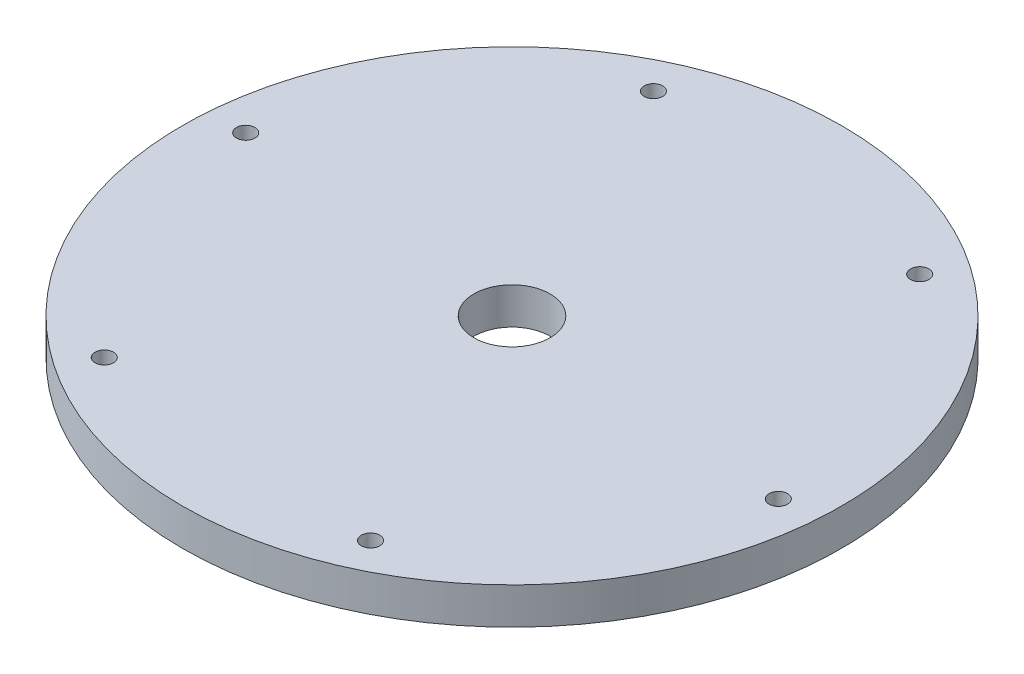
ISO-10303-21;
HEADER;
FILE_DESCRIPTION(('STEP AP214'),'2;1');
FILE_NAME('part.step','',(''),(''),'','','');
FILE_SCHEMA(('AUTOMOTIVE_DESIGN { 1 0 10303 214 1 1 1 1 }'));
ENDSEC;
DATA;
#1=APPLICATION_CONTEXT('core data for automotive mechanical design processes');
#2=APPLICATION_PROTOCOL_DEFINITION('international standard','automotive_design',2000,#1);
#3=PRODUCT_CONTEXT('',#1,'mechanical');
#4=PRODUCT('Part','Part','',(#3));
#5=PRODUCT_RELATED_PRODUCT_CATEGORY('part','',(#4));
#6=PRODUCT_DEFINITION_FORMATION('','',#4);
#7=PRODUCT_DEFINITION_CONTEXT('part definition',#1,'design');
#8=PRODUCT_DEFINITION('design','',#6,#7);
#9=PRODUCT_DEFINITION_SHAPE('','',#8);
#10=(LENGTH_UNIT() NAMED_UNIT(*) SI_UNIT(.MILLI.,.METRE.));
#11=(NAMED_UNIT(*) PLANE_ANGLE_UNIT() SI_UNIT($,.RADIAN.));
#12=(NAMED_UNIT(*) SI_UNIT($,.STERADIAN.) SOLID_ANGLE_UNIT());
#13=UNCERTAINTY_MEASURE_WITH_UNIT(LENGTH_MEASURE(1.E-05),#10,'distance_accuracy_value','');
#14=(GEOMETRIC_REPRESENTATION_CONTEXT(3) GLOBAL_UNCERTAINTY_ASSIGNED_CONTEXT((#13)) GLOBAL_UNIT_ASSIGNED_CONTEXT((#10,
#11,#12)) REPRESENTATION_CONTEXT('',''));
#15=CARTESIAN_POINT('',(0.,0.,0.));
#16=DIRECTION('',(0.,0.,1.));
#17=DIRECTION('',(1.,0.,0.));
#18=AXIS2_PLACEMENT_3D('',#15,#16,#17);
#19=CARTESIAN_POINT('',(0.,5.9563,0.));
#20=DIRECTION('',(0.,1.,0.));
#21=DIRECTION('',(0.,0.,1.));
#22=AXIS2_PLACEMENT_3D('',#19,#20,#21);
#23=PLANE('',#22);
#24=CARTESIAN_POINT('',(-20.122190112367,5.9563,-43.1032939849393));
#25=DIRECTION('',(0.,1.,0.));
#26=DIRECTION('',(0.,0.,1.));
#27=AXIS2_PLACEMENT_3D('',#24,#25,#26);
#28=CIRCLE('',#27,1.4986);
#29=CARTESIAN_POINT('',(-20.122190112367,5.9563,-41.6046939849393));
#30=VERTEX_POINT('',#29);
#31=EDGE_CURVE('E90',#30,#30,#28,.T.);
#32=ORIENTED_EDGE('',*,*,#31,.F.);
#33=EDGE_LOOP('',(#32));
#34=FACE_BOUND('',#33,.T.);
#35=CARTESIAN_POINT('',(-27.2674525215629,5.9563,38.9779748095595));
#36=DIRECTION('',(0.,1.,0.));
#37=DIRECTION('',(0.,0.,1.));
#38=AXIS2_PLACEMENT_3D('',#35,#36,#37);
#39=CIRCLE('',#38,1.4986);
#40=CARTESIAN_POINT('',(-27.2674525215629,5.9563,40.4765748095595));
#41=VERTEX_POINT('',#40);
#42=EDGE_CURVE('E74',#41,#41,#39,.T.);
#43=ORIENTED_EDGE('',*,*,#42,.F.);
#44=EDGE_LOOP('',(#43));
#45=FACE_BOUND('',#44,.T.);
#46=CARTESIAN_POINT('',(47.3896426339299,5.9563,4.12531917537975));
#47=DIRECTION('',(0.,1.,0.));
#48=DIRECTION('',(0.,0.,1.));
#49=AXIS2_PLACEMENT_3D('',#46,#47,#48);
#50=CIRCLE('',#49,1.4986);
#51=CARTESIAN_POINT('',(47.3896426339299,5.9563,5.62391917537975));
#52=VERTEX_POINT('',#51);
#53=EDGE_CURVE('E58',#52,#52,#50,.T.);
#54=ORIENTED_EDGE('',*,*,#53,.F.);
#55=EDGE_LOOP('',(#54));
#56=FACE_BOUND('',#55,.T.);
#57=CARTESIAN_POINT('',(0.,5.9563,0.));
#58=DIRECTION('',(0.,1.,0.));
#59=DIRECTION('',(0.,0.,1.));
#60=AXIS2_PLACEMENT_3D('',#57,#58,#59);
#61=CIRCLE('',#60,53.5432);
#62=CARTESIAN_POINT('',(0.,5.9563,53.5432));
#63=VERTEX_POINT('',#62);
#64=EDGE_CURVE('E10',#63,#63,#61,.T.);
#65=ORIENTED_EDGE('',*,*,#64,.T.);
#66=EDGE_LOOP('',(#65));
#67=FACE_BOUND('',#66,.T.);
#68=CARTESIAN_POINT('',(0.,5.9563,0.));
#69=DIRECTION('',(0.,1.,0.));
#70=DIRECTION('',(0.,0.,1.));
#71=AXIS2_PLACEMENT_3D('',#68,#69,#70);
#72=CIRCLE('',#71,6.1849);
#73=CARTESIAN_POINT('',(0.,5.9563,6.1849));
#74=VERTEX_POINT('',#73);
#75=EDGE_CURVE('E52',#74,#74,#72,.T.);
#76=ORIENTED_EDGE('',*,*,#75,.F.);
#77=EDGE_LOOP('',(#76));
#78=FACE_BOUND('',#77,.T.);
#79=CARTESIAN_POINT('',(20.122190112367,5.9563,43.1032939849393));
#80=DIRECTION('',(0.,1.,0.));
#81=DIRECTION('',(0.,0.,1.));
#82=AXIS2_PLACEMENT_3D('',#79,#80,#81);
#83=CIRCLE('',#82,1.4986);
#84=CARTESIAN_POINT('',(20.122190112367,5.9563,44.6018939849393));
#85=VERTEX_POINT('',#84);
#86=EDGE_CURVE('E66',#85,#85,#83,.T.);
#87=ORIENTED_EDGE('',*,*,#86,.F.);
#88=EDGE_LOOP('',(#87));
#89=FACE_BOUND('',#88,.T.);
#90=CARTESIAN_POINT('',(-47.3896426339299,5.9563,-4.12531917537974));
#91=DIRECTION('',(0.,1.,0.));
#92=DIRECTION('',(0.,0.,1.));
#93=AXIS2_PLACEMENT_3D('',#90,#91,#92);
#94=CIRCLE('',#93,1.4986);
#95=CARTESIAN_POINT('',(-47.3896426339299,5.9563,-2.62671917537975));
#96=VERTEX_POINT('',#95);
#97=EDGE_CURVE('E82',#96,#96,#94,.T.);
#98=ORIENTED_EDGE('',*,*,#97,.F.);
#99=EDGE_LOOP('',(#98));
#100=FACE_BOUND('',#99,.T.);
#101=CARTESIAN_POINT('',(27.2674525215629,5.9563,-38.9779748095595));
#102=DIRECTION('',(0.,1.,0.));
#103=DIRECTION('',(0.,0.,1.));
#104=AXIS2_PLACEMENT_3D('',#101,#102,#103);
#105=CIRCLE('',#104,1.4986);
#106=CARTESIAN_POINT('',(27.2674525215629,5.9563,-37.4793748095595));
#107=VERTEX_POINT('',#106);
#108=EDGE_CURVE('E98',#107,#107,#105,.T.);
#109=ORIENTED_EDGE('',*,*,#108,.F.);
#110=EDGE_LOOP('',(#109));
#111=FACE_BOUND('',#110,.T.);
#112=ADVANCED_FACE('F39',(#34,#45,#56,#67,#78,#89,#100,#111),#23,.T.);
#113=CARTESIAN_POINT('',(0.,0.,0.));
#114=DIRECTION('',(0.,1.,0.));
#115=DIRECTION('',(0.,0.,1.));
#116=AXIS2_PLACEMENT_3D('',#113,#114,#115);
#117=PLANE('',#116);
#118=CARTESIAN_POINT('',(0.,0.,0.));
#119=DIRECTION('',(0.,1.,0.));
#120=DIRECTION('',(0.,0.,1.));
#121=AXIS2_PLACEMENT_3D('',#118,#119,#120);
#122=CIRCLE('',#121,53.5432);
#123=CARTESIAN_POINT('',(0.,0.,53.5432));
#124=VERTEX_POINT('',#123);
#125=EDGE_CURVE('E43',#124,#124,#122,.T.);
#126=ORIENTED_EDGE('',*,*,#125,.F.);
#127=EDGE_LOOP('',(#126));
#128=FACE_BOUND('',#127,.T.);
#129=CARTESIAN_POINT('',(0.,0.,0.));
#130=DIRECTION('',(0.,1.,0.));
#131=DIRECTION('',(0.,0.,1.));
#132=AXIS2_PLACEMENT_3D('',#129,#130,#131);
#133=CIRCLE('',#132,6.1849);
#134=CARTESIAN_POINT('',(0.,0.,6.1849));
#135=VERTEX_POINT('',#134);
#136=EDGE_CURVE('E54',#135,#135,#133,.T.);
#137=ORIENTED_EDGE('',*,*,#136,.T.);
#138=EDGE_LOOP('',(#137));
#139=FACE_BOUND('',#138,.T.);
#140=CARTESIAN_POINT('',(47.3896426339299,0.,4.12531917537975));
#141=DIRECTION('',(0.,1.,0.));
#142=DIRECTION('',(0.,0.,1.));
#143=AXIS2_PLACEMENT_3D('',#140,#141,#142);
#144=CIRCLE('',#143,1.4986);
#145=CARTESIAN_POINT('',(47.3896426339299,0.,5.62391917537975));
#146=VERTEX_POINT('',#145);
#147=EDGE_CURVE('E62',#146,#146,#144,.T.);
#148=ORIENTED_EDGE('',*,*,#147,.T.);
#149=EDGE_LOOP('',(#148));
#150=FACE_BOUND('',#149,.T.);
#151=CARTESIAN_POINT('',(20.122190112367,0.,43.1032939849393));
#152=DIRECTION('',(0.,1.,0.));
#153=DIRECTION('',(0.,0.,1.));
#154=AXIS2_PLACEMENT_3D('',#151,#152,#153);
#155=CIRCLE('',#154,1.4986);
#156=CARTESIAN_POINT('',(20.122190112367,0.,44.6018939849393));
#157=VERTEX_POINT('',#156);
#158=EDGE_CURVE('E70',#157,#157,#155,.T.);
#159=ORIENTED_EDGE('',*,*,#158,.T.);
#160=EDGE_LOOP('',(#159));
#161=FACE_BOUND('',#160,.T.);
#162=CARTESIAN_POINT('',(-27.2674525215629,0.,38.9779748095595));
#163=DIRECTION('',(0.,1.,0.));
#164=DIRECTION('',(0.,0.,1.));
#165=AXIS2_PLACEMENT_3D('',#162,#163,#164);
#166=CIRCLE('',#165,1.4986);
#167=CARTESIAN_POINT('',(-27.2674525215629,0.,40.4765748095595));
#168=VERTEX_POINT('',#167);
#169=EDGE_CURVE('E78',#168,#168,#166,.T.);
#170=ORIENTED_EDGE('',*,*,#169,.T.);
#171=EDGE_LOOP('',(#170));
#172=FACE_BOUND('',#171,.T.);
#173=CARTESIAN_POINT('',(-47.3896426339299,0.,-4.12531917537974));
#174=DIRECTION('',(0.,1.,0.));
#175=DIRECTION('',(0.,0.,1.));
#176=AXIS2_PLACEMENT_3D('',#173,#174,#175);
#177=CIRCLE('',#176,1.4986);
#178=CARTESIAN_POINT('',(-47.3896426339299,0.,-2.62671917537975));
#179=VERTEX_POINT('',#178);
#180=EDGE_CURVE('E86',#179,#179,#177,.T.);
#181=ORIENTED_EDGE('',*,*,#180,.T.);
#182=EDGE_LOOP('',(#181));
#183=FACE_BOUND('',#182,.T.);
#184=CARTESIAN_POINT('',(-20.122190112367,0.,-43.1032939849393));
#185=DIRECTION('',(0.,1.,0.));
#186=DIRECTION('',(0.,0.,1.));
#187=AXIS2_PLACEMENT_3D('',#184,#185,#186);
#188=CIRCLE('',#187,1.4986);
#189=CARTESIAN_POINT('',(-20.122190112367,0.,-41.6046939849393));
#190=VERTEX_POINT('',#189);
#191=EDGE_CURVE('E94',#190,#190,#188,.T.);
#192=ORIENTED_EDGE('',*,*,#191,.T.);
#193=EDGE_LOOP('',(#192));
#194=FACE_BOUND('',#193,.T.);
#195=CARTESIAN_POINT('',(27.2674525215629,0.,-38.9779748095595));
#196=DIRECTION('',(0.,1.,0.));
#197=DIRECTION('',(0.,0.,1.));
#198=AXIS2_PLACEMENT_3D('',#195,#196,#197);
#199=CIRCLE('',#198,1.4986);
#200=CARTESIAN_POINT('',(27.2674525215629,0.,-37.4793748095595));
#201=VERTEX_POINT('',#200);
#202=EDGE_CURVE('E102',#201,#201,#199,.T.);
#203=ORIENTED_EDGE('',*,*,#202,.T.);
#204=EDGE_LOOP('',(#203));
#205=FACE_BOUND('',#204,.T.);
#206=ADVANCED_FACE('F114',(#128,#139,#150,#161,#172,#183,#194,#205),#117,.F.);
#207=CARTESIAN_POINT('',(0.,5.9563,0.));
#208=DIRECTION('',(0.,-1.,0.));
#209=DIRECTION('',(0.,0.,-1.));
#210=AXIS2_PLACEMENT_3D('',#207,#208,#209);
#211=CYLINDRICAL_SURFACE('',#210,53.5432);
#212=ORIENTED_EDGE('',*,*,#64,.F.);
#213=EDGE_LOOP('',(#212));
#214=FACE_BOUND('',#213,.T.);
#215=ORIENTED_EDGE('',*,*,#125,.T.);
#216=EDGE_LOOP('',(#215));
#217=FACE_BOUND('',#216,.T.);
#218=ADVANCED_FACE('F41',(#214,#217),#211,.T.);
#219=CARTESIAN_POINT('',(0.,5.9563,0.));
#220=DIRECTION('',(0.,-1.,0.));
#221=DIRECTION('',(0.,0.,-1.));
#222=AXIS2_PLACEMENT_3D('',#219,#220,#221);
#223=CYLINDRICAL_SURFACE('',#222,6.1849);
#224=ORIENTED_EDGE('',*,*,#75,.T.);
#225=EDGE_LOOP('',(#224));
#226=FACE_BOUND('',#225,.T.);
#227=ORIENTED_EDGE('',*,*,#136,.F.);
#228=EDGE_LOOP('',(#227));
#229=FACE_BOUND('',#228,.T.);
#230=ADVANCED_FACE('F124',(#226,#229),#223,.F.);
#231=CARTESIAN_POINT('',(47.3896426339299,5.9563,4.12531917537975));
#232=DIRECTION('',(0.,-1.,0.));
#233=DIRECTION('',(0.,0.,-1.));
#234=AXIS2_PLACEMENT_3D('',#231,#232,#233);
#235=CYLINDRICAL_SURFACE('',#234,1.4986);
#236=ORIENTED_EDGE('',*,*,#53,.T.);
#237=EDGE_LOOP('',(#236));
#238=FACE_BOUND('',#237,.T.);
#239=ORIENTED_EDGE('',*,*,#147,.F.);
#240=EDGE_LOOP('',(#239));
#241=FACE_BOUND('',#240,.T.);
#242=ADVANCED_FACE('F127',(#238,#241),#235,.F.);
#243=CARTESIAN_POINT('',(20.122190112367,5.9563,43.1032939849393));
#244=DIRECTION('',(0.,-1.,0.));
#245=DIRECTION('',(0.,0.,-1.));
#246=AXIS2_PLACEMENT_3D('',#243,#244,#245);
#247=CYLINDRICAL_SURFACE('',#246,1.4986);
#248=ORIENTED_EDGE('',*,*,#86,.T.);
#249=EDGE_LOOP('',(#248));
#250=FACE_BOUND('',#249,.T.);
#251=ORIENTED_EDGE('',*,*,#158,.F.);
#252=EDGE_LOOP('',(#251));
#253=FACE_BOUND('',#252,.T.);
#254=ADVANCED_FACE('F131',(#250,#253),#247,.F.);
#255=CARTESIAN_POINT('',(-27.2674525215629,5.9563,38.9779748095595));
#256=DIRECTION('',(0.,-1.,0.));
#257=DIRECTION('',(0.,0.,-1.));
#258=AXIS2_PLACEMENT_3D('',#255,#256,#257);
#259=CYLINDRICAL_SURFACE('',#258,1.4986);
#260=ORIENTED_EDGE('',*,*,#42,.T.);
#261=EDGE_LOOP('',(#260));
#262=FACE_BOUND('',#261,.T.);
#263=ORIENTED_EDGE('',*,*,#169,.F.);
#264=EDGE_LOOP('',(#263));
#265=FACE_BOUND('',#264,.T.);
#266=ADVANCED_FACE('F135',(#262,#265),#259,.F.);
#267=CARTESIAN_POINT('',(-47.3896426339299,5.9563,-4.12531917537974));
#268=DIRECTION('',(0.,-1.,0.));
#269=DIRECTION('',(0.,0.,-1.));
#270=AXIS2_PLACEMENT_3D('',#267,#268,#269);
#271=CYLINDRICAL_SURFACE('',#270,1.4986);
#272=ORIENTED_EDGE('',*,*,#97,.T.);
#273=EDGE_LOOP('',(#272));
#274=FACE_BOUND('',#273,.T.);
#275=ORIENTED_EDGE('',*,*,#180,.F.);
#276=EDGE_LOOP('',(#275));
#277=FACE_BOUND('',#276,.T.);
#278=ADVANCED_FACE('F139',(#274,#277),#271,.F.);
#279=CARTESIAN_POINT('',(-20.122190112367,5.9563,-43.1032939849393));
#280=DIRECTION('',(0.,-1.,0.));
#281=DIRECTION('',(0.,0.,-1.));
#282=AXIS2_PLACEMENT_3D('',#279,#280,#281);
#283=CYLINDRICAL_SURFACE('',#282,1.4986);
#284=ORIENTED_EDGE('',*,*,#31,.T.);
#285=EDGE_LOOP('',(#284));
#286=FACE_BOUND('',#285,.T.);
#287=ORIENTED_EDGE('',*,*,#191,.F.);
#288=EDGE_LOOP('',(#287));
#289=FACE_BOUND('',#288,.T.);
#290=ADVANCED_FACE('F143',(#286,#289),#283,.F.);
#291=CARTESIAN_POINT('',(27.2674525215629,5.9563,-38.9779748095595));
#292=DIRECTION('',(0.,-1.,0.));
#293=DIRECTION('',(0.,0.,-1.));
#294=AXIS2_PLACEMENT_3D('',#291,#292,#293);
#295=CYLINDRICAL_SURFACE('',#294,1.4986);
#296=ORIENTED_EDGE('',*,*,#108,.T.);
#297=EDGE_LOOP('',(#296));
#298=FACE_BOUND('',#297,.T.);
#299=ORIENTED_EDGE('',*,*,#202,.F.);
#300=EDGE_LOOP('',(#299));
#301=FACE_BOUND('',#300,.T.);
#302=ADVANCED_FACE('F110',(#298,#301),#295,.F.);
#303=CLOSED_SHELL('',(#112,#206,#218,#230,#242,#254,#266,#278,#290,#302));
#304=MANIFOLD_SOLID_BREP('B2',#303);
#305=ADVANCED_BREP_SHAPE_REPRESENTATION('',(#18,#304),#14);
#306=SHAPE_DEFINITION_REPRESENTATION(#9,#305);
ENDSEC;
END-ISO-10303-21;
